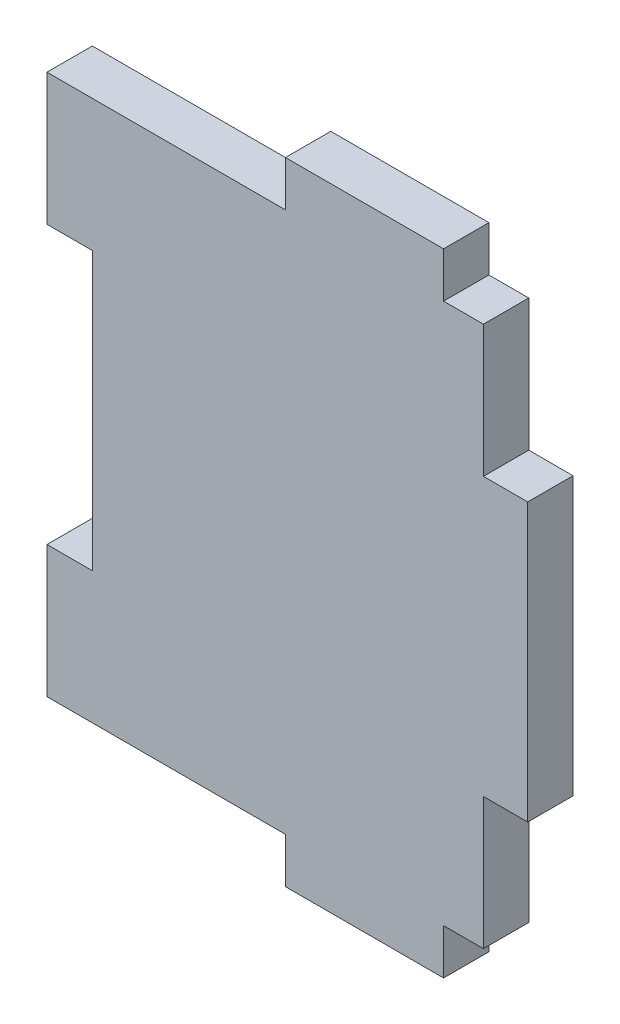
ISO-10303-21;
HEADER;
FILE_DESCRIPTION(('STEP AP214'),'2;1');
FILE_NAME('part.step','',(''),(''),'','','');
FILE_SCHEMA(('AUTOMOTIVE_DESIGN { 1 0 10303 214 1 1 1 1 }'));
ENDSEC;
DATA;
#1=APPLICATION_CONTEXT('core data for automotive mechanical design processes');
#2=APPLICATION_PROTOCOL_DEFINITION('international standard','automotive_design',2000,#1);
#3=PRODUCT_CONTEXT('',#1,'mechanical');
#4=PRODUCT('Part','Part','',(#3));
#5=PRODUCT_RELATED_PRODUCT_CATEGORY('part','',(#4));
#6=PRODUCT_DEFINITION_FORMATION('','',#4);
#7=PRODUCT_DEFINITION_CONTEXT('part definition',#1,'design');
#8=PRODUCT_DEFINITION('design','',#6,#7);
#9=PRODUCT_DEFINITION_SHAPE('','',#8);
#10=(LENGTH_UNIT() NAMED_UNIT(*) SI_UNIT(.MILLI.,.METRE.));
#11=(NAMED_UNIT(*) PLANE_ANGLE_UNIT() SI_UNIT($,.RADIAN.));
#12=(NAMED_UNIT(*) SI_UNIT($,.STERADIAN.) SOLID_ANGLE_UNIT());
#13=UNCERTAINTY_MEASURE_WITH_UNIT(LENGTH_MEASURE(1.E-05),#10,'distance_accuracy_value','');
#14=(GEOMETRIC_REPRESENTATION_CONTEXT(3) GLOBAL_UNCERTAINTY_ASSIGNED_CONTEXT((#13)) GLOBAL_UNIT_ASSIGNED_CONTEXT((#10,
#11,#12)) REPRESENTATION_CONTEXT('',''));
#15=CARTESIAN_POINT('',(0.,0.,0.));
#16=DIRECTION('',(0.,0.,1.));
#17=DIRECTION('',(1.,0.,0.));
#18=AXIS2_PLACEMENT_3D('',#15,#16,#17);
#19=CARTESIAN_POINT('',(0.,-32.5755,5.461));
#20=DIRECTION('',(0.,1.,0.));
#21=DIRECTION('',(0.,0.,1.));
#22=AXIS2_PLACEMENT_3D('',#19,#20,#21);
#23=PLANE('',#22);
#24=DIRECTION('',(0.,0.,1.));
#25=VECTOR('',#24,1.);
#26=CARTESIAN_POINT('',(21.4884,-32.5755,-19.8172909601691));
#27=LINE('',#26,#25);
#28=CARTESIAN_POINT('',(21.4884,-32.5755,0.));
#29=VERTEX_POINT('',#28);
#30=CARTESIAN_POINT('',(21.4884,-32.5755,5.461));
#31=VERTEX_POINT('',#30);
#32=EDGE_CURVE('E58',#29,#31,#27,.T.);
#33=ORIENTED_EDGE('',*,*,#32,.F.);
#34=DIRECTION('',(1.,0.,0.));
#35=VECTOR('',#34,1.);
#36=CARTESIAN_POINT('',(0.,-32.5755,0.));
#37=LINE('',#36,#35);
#38=CARTESIAN_POINT('',(26.289,-32.5755,0.));
#39=VERTEX_POINT('',#38);
#40=EDGE_CURVE('E266',#29,#39,#37,.T.);
#41=ORIENTED_EDGE('',*,*,#40,.T.);
#42=DIRECTION('',(0.,0.,-1.));
#43=VECTOR('',#42,1.);
#44=CARTESIAN_POINT('',(26.289,-32.5755,5.461));
#45=LINE('',#44,#43);
#46=CARTESIAN_POINT('',(26.289,-32.5755,5.461));
#47=VERTEX_POINT('',#46);
#48=EDGE_CURVE('E172',#47,#39,#45,.T.);
#49=ORIENTED_EDGE('',*,*,#48,.F.);
#50=DIRECTION('',(1.,0.,0.));
#51=VECTOR('',#50,1.);
#52=CARTESIAN_POINT('',(0.,-32.5755,5.461));
#53=LINE('',#52,#51);
#54=EDGE_CURVE('E170',#31,#47,#53,.T.);
#55=ORIENTED_EDGE('',*,*,#54,.F.);
#56=EDGE_LOOP('',(#33,#41,#49,#55));
#57=FACE_BOUND('',#56,.T.);
#58=ADVANCED_FACE('F35',(#57),#23,.F.);
#59=CARTESIAN_POINT('',(0.,32.5755,5.461));
#60=DIRECTION('',(0.,1.,0.));
#61=DIRECTION('',(0.,0.,1.));
#62=AXIS2_PLACEMENT_3D('',#59,#60,#61);
#63=PLANE('',#62);
#64=DIRECTION('',(1.,0.,0.));
#65=VECTOR('',#64,1.);
#66=CARTESIAN_POINT('',(0.,32.5755,0.));
#67=LINE('',#66,#65);
#68=CARTESIAN_POINT('',(21.4884,32.5755,0.));
#69=VERTEX_POINT('',#68);
#70=CARTESIAN_POINT('',(26.289,32.5755,0.));
#71=VERTEX_POINT('',#70);
#72=EDGE_CURVE('E284',#69,#71,#67,.T.);
#73=ORIENTED_EDGE('',*,*,#72,.F.);
#74=DIRECTION('',(0.,0.,1.));
#75=VECTOR('',#74,1.);
#76=CARTESIAN_POINT('',(21.4884,32.5755,-19.8172909601691));
#77=LINE('',#76,#75);
#78=CARTESIAN_POINT('',(21.4884,32.5755,5.461));
#79=VERTEX_POINT('',#78);
#80=EDGE_CURVE('E210',#69,#79,#77,.T.);
#81=ORIENTED_EDGE('',*,*,#80,.T.);
#82=DIRECTION('',(1.,0.,0.));
#83=VECTOR('',#82,1.);
#84=CARTESIAN_POINT('',(0.,32.5755,5.461));
#85=LINE('',#84,#83);
#86=CARTESIAN_POINT('',(26.289,32.5755,5.461));
#87=VERTEX_POINT('',#86);
#88=EDGE_CURVE('E256',#79,#87,#85,.T.);
#89=ORIENTED_EDGE('',*,*,#88,.T.);
#90=DIRECTION('',(0.,0.,-1.));
#91=VECTOR('',#90,1.);
#92=CARTESIAN_POINT('',(26.289,32.5755,5.461));
#93=LINE('',#92,#91);
#94=EDGE_CURVE('E289',#87,#71,#93,.T.);
#95=ORIENTED_EDGE('',*,*,#94,.T.);
#96=EDGE_LOOP('',(#73,#81,#89,#95));
#97=FACE_BOUND('',#96,.T.);
#98=ADVANCED_FACE('F348',(#97),#63,.T.);
#99=CARTESIAN_POINT('',(0.,16.7005,5.461));
#100=DIRECTION('',(0.,-1.,0.));
#101=DIRECTION('',(1.,0.,0.));
#102=AXIS2_PLACEMENT_3D('',#99,#100,#101);
#103=PLANE('',#102);
#104=DIRECTION('',(-1.,0.,0.));
#105=VECTOR('',#104,1.);
#106=CARTESIAN_POINT('',(0.,16.7005,0.));
#107=LINE('',#106,#105);
#108=CARTESIAN_POINT('',(-20.828,16.7005,0.));
#109=VERTEX_POINT('',#108);
#110=CARTESIAN_POINT('',(-26.289,16.7005,0.));
#111=VERTEX_POINT('',#110);
#112=EDGE_CURVE('E232',#109,#111,#107,.T.);
#113=ORIENTED_EDGE('',*,*,#112,.F.);
#114=DIRECTION('',(0.,0.,-1.));
#115=VECTOR('',#114,1.);
#116=CARTESIAN_POINT('',(-20.828,16.7005,5.461));
#117=LINE('',#116,#115);
#118=CARTESIAN_POINT('',(-20.828,16.7005,5.461));
#119=VERTEX_POINT('',#118);
#120=EDGE_CURVE('E11',#119,#109,#117,.T.);
#121=ORIENTED_EDGE('',*,*,#120,.F.);
#122=DIRECTION('',(-1.,0.,0.));
#123=VECTOR('',#122,1.);
#124=CARTESIAN_POINT('',(0.,16.7005,5.461));
#125=LINE('',#124,#123);
#126=CARTESIAN_POINT('',(-26.289,16.7005,5.461));
#127=VERTEX_POINT('',#126);
#128=EDGE_CURVE('E233',#119,#127,#125,.T.);
#129=ORIENTED_EDGE('',*,*,#128,.T.);
#130=DIRECTION('',(0.,0.,-1.));
#131=VECTOR('',#130,1.);
#132=CARTESIAN_POINT('',(-26.289,16.7005,5.461));
#133=LINE('',#132,#131);
#134=EDGE_CURVE('E285',#127,#111,#133,.T.);
#135=ORIENTED_EDGE('',*,*,#134,.T.);
#136=EDGE_LOOP('',(#113,#121,#129,#135));
#137=FACE_BOUND('',#136,.T.);
#138=ADVANCED_FACE('F37',(#137),#103,.T.);
#139=CARTESIAN_POINT('',(-20.828,0.,5.461));
#140=DIRECTION('',(-1.,0.,0.));
#141=DIRECTION('',(0.,0.,1.));
#142=AXIS2_PLACEMENT_3D('',#139,#140,#141);
#143=PLANE('',#142);
#144=DIRECTION('',(0.,1.,0.));
#145=VECTOR('',#144,1.);
#146=CARTESIAN_POINT('',(-20.828,0.,0.));
#147=LINE('',#146,#145);
#148=CARTESIAN_POINT('',(-20.828,-16.7005,0.));
#149=VERTEX_POINT('',#148);
#150=EDGE_CURVE('E259',#149,#109,#147,.T.);
#151=ORIENTED_EDGE('',*,*,#150,.F.);
#152=DIRECTION('',(0.,0.,-1.));
#153=VECTOR('',#152,1.);
#154=CARTESIAN_POINT('',(-20.828,-16.7005,5.461));
#155=LINE('',#154,#153);
#156=CARTESIAN_POINT('',(-20.828,-16.7005,5.461));
#157=VERTEX_POINT('',#156);
#158=EDGE_CURVE('E43',#157,#149,#155,.T.);
#159=ORIENTED_EDGE('',*,*,#158,.F.);
#160=DIRECTION('',(0.,1.,0.));
#161=VECTOR('',#160,1.);
#162=CARTESIAN_POINT('',(-20.828,0.,5.461));
#163=LINE('',#162,#161);
#164=EDGE_CURVE('E236',#157,#119,#163,.T.);
#165=ORIENTED_EDGE('',*,*,#164,.T.);
#166=ORIENTED_EDGE('',*,*,#120,.T.);
#167=EDGE_LOOP('',(#151,#159,#165,#166));
#168=FACE_BOUND('',#167,.T.);
#169=ADVANCED_FACE('F319',(#168),#143,.T.);
#170=CARTESIAN_POINT('',(0.,-16.7005,5.461));
#171=DIRECTION('',(0.,-1.,0.));
#172=DIRECTION('',(0.,0.,-1.));
#173=AXIS2_PLACEMENT_3D('',#170,#171,#172);
#174=PLANE('',#173);
#175=DIRECTION('',(-1.,0.,0.));
#176=VECTOR('',#175,1.);
#177=CARTESIAN_POINT('',(0.,-16.7005,0.));
#178=LINE('',#177,#176);
#179=CARTESIAN_POINT('',(-26.289,-16.7005,0.));
#180=VERTEX_POINT('',#179);
#181=EDGE_CURVE('E262',#149,#180,#178,.T.);
#182=ORIENTED_EDGE('',*,*,#181,.T.);
#183=DIRECTION('',(0.,0.,-1.));
#184=VECTOR('',#183,1.);
#185=CARTESIAN_POINT('',(-26.289,-16.7005,5.461));
#186=LINE('',#185,#184);
#187=CARTESIAN_POINT('',(-26.289,-16.7005,5.461));
#188=VERTEX_POINT('',#187);
#189=EDGE_CURVE('E305',#188,#180,#186,.T.);
#190=ORIENTED_EDGE('',*,*,#189,.F.);
#191=DIRECTION('',(-1.,0.,0.));
#192=VECTOR('',#191,1.);
#193=CARTESIAN_POINT('',(0.,-16.7005,5.461));
#194=LINE('',#193,#192);
#195=EDGE_CURVE('E240',#157,#188,#194,.T.);
#196=ORIENTED_EDGE('',*,*,#195,.F.);
#197=ORIENTED_EDGE('',*,*,#158,.T.);
#198=EDGE_LOOP('',(#182,#190,#196,#197));
#199=FACE_BOUND('',#198,.T.);
#200=ADVANCED_FACE('F310',(#199),#174,.F.);
#201=CARTESIAN_POINT('',(-26.289,0.,5.461));
#202=DIRECTION('',(1.,0.,0.));
#203=DIRECTION('',(0.,0.,-1.));
#204=AXIS2_PLACEMENT_3D('',#201,#202,#203);
#205=PLANE('',#204);
#206=DIRECTION('',(0.,-1.,0.));
#207=VECTOR('',#206,1.);
#208=CARTESIAN_POINT('',(-26.289,0.,0.));
#209=LINE('',#208,#207);
#210=CARTESIAN_POINT('',(-26.289,-32.5755,0.));
#211=VERTEX_POINT('',#210);
#212=EDGE_CURVE('E264',#180,#211,#209,.T.);
#213=ORIENTED_EDGE('',*,*,#212,.T.);
#214=DIRECTION('',(0.,0.,-1.));
#215=VECTOR('',#214,1.);
#216=CARTESIAN_POINT('',(-26.289,-32.5755,5.461));
#217=LINE('',#216,#215);
#218=CARTESIAN_POINT('',(-26.289,-32.5755,5.461));
#219=VERTEX_POINT('',#218);
#220=EDGE_CURVE('E302',#219,#211,#217,.T.);
#221=ORIENTED_EDGE('',*,*,#220,.F.);
#222=DIRECTION('',(0.,-1.,0.));
#223=VECTOR('',#222,1.);
#224=CARTESIAN_POINT('',(-26.289,0.,5.461));
#225=LINE('',#224,#223);
#226=EDGE_CURVE('E178',#188,#219,#225,.T.);
#227=ORIENTED_EDGE('',*,*,#226,.F.);
#228=ORIENTED_EDGE('',*,*,#189,.T.);
#229=EDGE_LOOP('',(#213,#221,#227,#228));
#230=FACE_BOUND('',#229,.T.);
#231=ADVANCED_FACE('F382',(#230),#205,.F.);
#232=CARTESIAN_POINT('',(2.4384,-32.5755,0.));
#233=VERTEX_POINT('',#232);
#234=EDGE_CURVE('E267',#211,#233,#37,.T.);
#235=ORIENTED_EDGE('',*,*,#234,.T.);
#236=DIRECTION('',(0.,0.,1.));
#237=VECTOR('',#236,1.);
#238=CARTESIAN_POINT('',(2.4384,-32.5755,-19.8172909601691));
#239=LINE('',#238,#237);
#240=CARTESIAN_POINT('',(2.4384,-32.5755,5.461));
#241=VERTEX_POINT('',#240);
#242=EDGE_CURVE('E50',#233,#241,#239,.T.);
#243=ORIENTED_EDGE('',*,*,#242,.T.);
#244=EDGE_CURVE('E177',#219,#241,#53,.T.);
#245=ORIENTED_EDGE('',*,*,#244,.F.);
#246=ORIENTED_EDGE('',*,*,#220,.T.);
#247=EDGE_LOOP('',(#235,#243,#245,#246));
#248=FACE_BOUND('',#247,.T.);
#249=ADVANCED_FACE('F374',(#248),#23,.F.);
#250=CARTESIAN_POINT('',(26.289,0.,5.461));
#251=DIRECTION('',(1.,0.,0.));
#252=DIRECTION('',(0.,0.,-1.));
#253=AXIS2_PLACEMENT_3D('',#250,#251,#252);
#254=PLANE('',#253);
#255=DIRECTION('',(0.,-1.,0.));
#256=VECTOR('',#255,1.);
#257=CARTESIAN_POINT('',(26.289,0.,0.));
#258=LINE('',#257,#256);
#259=CARTESIAN_POINT('',(26.289,-16.7005,0.));
#260=VERTEX_POINT('',#259);
#261=EDGE_CURVE('E269',#260,#39,#258,.T.);
#262=ORIENTED_EDGE('',*,*,#261,.F.);
#263=DIRECTION('',(0.,0.,-1.));
#264=VECTOR('',#263,1.);
#265=CARTESIAN_POINT('',(26.289,-16.7005,5.461));
#266=LINE('',#265,#264);
#267=CARTESIAN_POINT('',(26.289,-16.7005,5.461));
#268=VERTEX_POINT('',#267);
#269=EDGE_CURVE('E299',#268,#260,#266,.T.);
#270=ORIENTED_EDGE('',*,*,#269,.F.);
#271=DIRECTION('',(0.,-1.,0.));
#272=VECTOR('',#271,1.);
#273=CARTESIAN_POINT('',(26.289,0.,5.461));
#274=LINE('',#273,#272);
#275=EDGE_CURVE('E244',#268,#47,#274,.T.);
#276=ORIENTED_EDGE('',*,*,#275,.T.);
#277=ORIENTED_EDGE('',*,*,#48,.T.);
#278=EDGE_LOOP('',(#262,#270,#276,#277));
#279=FACE_BOUND('',#278,.T.);
#280=ADVANCED_FACE('F372',(#279),#254,.T.);
#281=CARTESIAN_POINT('',(0.,-16.7005,5.461));
#282=DIRECTION('',(0.,-1.,0.));
#283=DIRECTION('',(1.,0.,0.));
#284=AXIS2_PLACEMENT_3D('',#281,#282,#283);
#285=PLANE('',#284);
#286=DIRECTION('',(-1.,0.,0.));
#287=VECTOR('',#286,1.);
#288=CARTESIAN_POINT('',(0.,-16.7005,0.));
#289=LINE('',#288,#287);
#290=CARTESIAN_POINT('',(31.623,-16.7005,0.));
#291=VERTEX_POINT('',#290);
#292=EDGE_CURVE('E272',#291,#260,#289,.T.);
#293=ORIENTED_EDGE('',*,*,#292,.F.);
#294=DIRECTION('',(0.,0.,-1.));
#295=VECTOR('',#294,1.);
#296=CARTESIAN_POINT('',(31.623,-16.7005,5.461));
#297=LINE('',#296,#295);
#298=CARTESIAN_POINT('',(31.623,-16.7005,5.461));
#299=VERTEX_POINT('',#298);
#300=EDGE_CURVE('E297',#299,#291,#297,.T.);
#301=ORIENTED_EDGE('',*,*,#300,.F.);
#302=DIRECTION('',(-1.,0.,0.));
#303=VECTOR('',#302,1.);
#304=CARTESIAN_POINT('',(0.,-16.7005,5.461));
#305=LINE('',#304,#303);
#306=EDGE_CURVE('E246',#299,#268,#305,.T.);
#307=ORIENTED_EDGE('',*,*,#306,.T.);
#308=ORIENTED_EDGE('',*,*,#269,.T.);
#309=EDGE_LOOP('',(#293,#301,#307,#308));
#310=FACE_BOUND('',#309,.T.);
#311=ADVANCED_FACE('F369',(#310),#285,.T.);
#312=CARTESIAN_POINT('',(31.623,0.,5.461));
#313=DIRECTION('',(-1.,0.,0.));
#314=DIRECTION('',(0.,0.,1.));
#315=AXIS2_PLACEMENT_3D('',#312,#313,#314);
#316=PLANE('',#315);
#317=DIRECTION('',(0.,1.,0.));
#318=VECTOR('',#317,1.);
#319=CARTESIAN_POINT('',(31.623,0.,0.));
#320=LINE('',#319,#318);
#321=CARTESIAN_POINT('',(31.623,16.7005,0.));
#322=VERTEX_POINT('',#321);
#323=EDGE_CURVE('E276',#291,#322,#320,.T.);
#324=ORIENTED_EDGE('',*,*,#323,.T.);
#325=DIRECTION('',(0.,0.,-1.));
#326=VECTOR('',#325,1.);
#327=CARTESIAN_POINT('',(31.623,16.7005,5.461));
#328=LINE('',#327,#326);
#329=CARTESIAN_POINT('',(31.623,16.7005,5.461));
#330=VERTEX_POINT('',#329);
#331=EDGE_CURVE('E294',#330,#322,#328,.T.);
#332=ORIENTED_EDGE('',*,*,#331,.F.);
#333=DIRECTION('',(0.,1.,0.));
#334=VECTOR('',#333,1.);
#335=CARTESIAN_POINT('',(31.623,0.,5.461));
#336=LINE('',#335,#334);
#337=EDGE_CURVE('E250',#299,#330,#336,.T.);
#338=ORIENTED_EDGE('',*,*,#337,.F.);
#339=ORIENTED_EDGE('',*,*,#300,.T.);
#340=EDGE_LOOP('',(#324,#332,#338,#339));
#341=FACE_BOUND('',#340,.T.);
#342=ADVANCED_FACE('F366',(#341),#316,.F.);
#343=CARTESIAN_POINT('',(0.,16.7005000000001,5.461));
#344=DIRECTION('',(0.,-1.,0.));
#345=DIRECTION('',(1.,0.,0.));
#346=AXIS2_PLACEMENT_3D('',#343,#344,#345);
#347=PLANE('',#346);
#348=DIRECTION('',(-1.,0.,0.));
#349=VECTOR('',#348,1.);
#350=CARTESIAN_POINT('',(0.,16.7005000000001,0.));
#351=LINE('',#350,#349);
#352=CARTESIAN_POINT('',(26.289,16.7005,0.));
#353=VERTEX_POINT('',#352);
#354=EDGE_CURVE('E278',#322,#353,#351,.T.);
#355=ORIENTED_EDGE('',*,*,#354,.T.);
#356=DIRECTION('',(0.,0.,-1.));
#357=VECTOR('',#356,1.);
#358=CARTESIAN_POINT('',(26.289,16.7005,5.461));
#359=LINE('',#358,#357);
#360=CARTESIAN_POINT('',(26.289,16.7005,5.461));
#361=VERTEX_POINT('',#360);
#362=EDGE_CURVE('E292',#361,#353,#359,.T.);
#363=ORIENTED_EDGE('',*,*,#362,.F.);
#364=DIRECTION('',(-1.,0.,0.));
#365=VECTOR('',#364,1.);
#366=CARTESIAN_POINT('',(0.,16.7005000000001,5.461));
#367=LINE('',#366,#365);
#368=EDGE_CURVE('E252',#330,#361,#367,.T.);
#369=ORIENTED_EDGE('',*,*,#368,.F.);
#370=ORIENTED_EDGE('',*,*,#331,.T.);
#371=EDGE_LOOP('',(#355,#363,#369,#370));
#372=FACE_BOUND('',#371,.T.);
#373=ADVANCED_FACE('F361',(#372),#347,.F.);
#374=EDGE_CURVE('E273',#71,#353,#258,.T.);
#375=ORIENTED_EDGE('',*,*,#374,.F.);
#376=ORIENTED_EDGE('',*,*,#94,.F.);
#377=EDGE_CURVE('E247',#87,#361,#274,.T.);
#378=ORIENTED_EDGE('',*,*,#377,.T.);
#379=ORIENTED_EDGE('',*,*,#362,.T.);
#380=EDGE_LOOP('',(#375,#376,#378,#379));
#381=FACE_BOUND('',#380,.T.);
#382=ADVANCED_FACE('F354',(#381),#254,.T.);
#383=DIRECTION('',(0.,0.,1.));
#384=VECTOR('',#383,1.);
#385=CARTESIAN_POINT('',(2.4384,32.5755,-19.8172909601691));
#386=LINE('',#385,#384);
#387=CARTESIAN_POINT('',(2.4384,32.5755,0.));
#388=VERTEX_POINT('',#387);
#389=CARTESIAN_POINT('',(2.4384,32.5755,5.461));
#390=VERTEX_POINT('',#389);
#391=EDGE_CURVE('E225',#388,#390,#386,.T.);
#392=ORIENTED_EDGE('',*,*,#391,.F.);
#393=CARTESIAN_POINT('',(-26.289,32.5755,0.));
#394=VERTEX_POINT('',#393);
#395=EDGE_CURVE('E281',#394,#388,#67,.T.);
#396=ORIENTED_EDGE('',*,*,#395,.F.);
#397=DIRECTION('',(0.,0.,-1.));
#398=VECTOR('',#397,1.);
#399=CARTESIAN_POINT('',(-26.289,32.5755,5.461));
#400=LINE('',#399,#398);
#401=CARTESIAN_POINT('',(-26.289,32.5755,5.461));
#402=VERTEX_POINT('',#401);
#403=EDGE_CURVE('E287',#402,#394,#400,.T.);
#404=ORIENTED_EDGE('',*,*,#403,.F.);
#405=EDGE_CURVE('E254',#402,#390,#85,.T.);
#406=ORIENTED_EDGE('',*,*,#405,.T.);
#407=EDGE_LOOP('',(#392,#396,#404,#406));
#408=FACE_BOUND('',#407,.T.);
#409=ADVANCED_FACE('F329',(#408),#63,.T.);
#410=EDGE_CURVE('E237',#394,#111,#209,.T.);
#411=ORIENTED_EDGE('',*,*,#410,.T.);
#412=ORIENTED_EDGE('',*,*,#134,.F.);
#413=EDGE_CURVE('E242',#402,#127,#225,.T.);
#414=ORIENTED_EDGE('',*,*,#413,.F.);
#415=ORIENTED_EDGE('',*,*,#403,.T.);
#416=EDGE_LOOP('',(#411,#412,#414,#415));
#417=FACE_BOUND('',#416,.T.);
#418=ADVANCED_FACE('F421',(#417),#205,.F.);
#419=CARTESIAN_POINT('',(0.,0.,5.461));
#420=DIRECTION('',(0.,0.,1.));
#421=DIRECTION('',(1.,0.,0.));
#422=AXIS2_PLACEMENT_3D('',#419,#420,#421);
#423=PLANE('',#422);
#424=ORIENTED_EDGE('',*,*,#128,.F.);
#425=ORIENTED_EDGE('',*,*,#164,.F.);
#426=ORIENTED_EDGE('',*,*,#195,.T.);
#427=ORIENTED_EDGE('',*,*,#226,.T.);
#428=ORIENTED_EDGE('',*,*,#244,.T.);
#429=DIRECTION('',(0.,-1.,0.));
#430=VECTOR('',#429,1.);
#431=CARTESIAN_POINT('',(2.4384,-32.5755,5.461));
#432=LINE('',#431,#430);
#433=CARTESIAN_POINT('',(2.4384,-38.0365,5.461));
#434=VERTEX_POINT('',#433);
#435=EDGE_CURVE('E194',#241,#434,#432,.T.);
#436=ORIENTED_EDGE('',*,*,#435,.T.);
#437=DIRECTION('',(1.,0.,0.));
#438=VECTOR('',#437,1.);
#439=CARTESIAN_POINT('',(21.4884,-38.0365,5.461));
#440=LINE('',#439,#438);
#441=CARTESIAN_POINT('',(21.4884,-38.0365,5.461));
#442=VERTEX_POINT('',#441);
#443=EDGE_CURVE('E188',#434,#442,#440,.T.);
#444=ORIENTED_EDGE('',*,*,#443,.T.);
#445=DIRECTION('',(0.,1.,0.));
#446=VECTOR('',#445,1.);
#447=CARTESIAN_POINT('',(21.4884,-32.5755,5.461));
#448=LINE('',#447,#446);
#449=EDGE_CURVE('E185',#442,#31,#448,.T.);
#450=ORIENTED_EDGE('',*,*,#449,.T.);
#451=ORIENTED_EDGE('',*,*,#54,.T.);
#452=ORIENTED_EDGE('',*,*,#275,.F.);
#453=ORIENTED_EDGE('',*,*,#306,.F.);
#454=ORIENTED_EDGE('',*,*,#337,.T.);
#455=ORIENTED_EDGE('',*,*,#368,.T.);
#456=ORIENTED_EDGE('',*,*,#377,.F.);
#457=ORIENTED_EDGE('',*,*,#88,.F.);
#458=DIRECTION('',(0.,1.,0.));
#459=VECTOR('',#458,1.);
#460=CARTESIAN_POINT('',(21.4884,32.5755,5.461));
#461=LINE('',#460,#459);
#462=CARTESIAN_POINT('',(21.4884,38.0365,5.461));
#463=VERTEX_POINT('',#462);
#464=EDGE_CURVE('E214',#79,#463,#461,.T.);
#465=ORIENTED_EDGE('',*,*,#464,.T.);
#466=DIRECTION('',(-1.,0.,0.));
#467=VECTOR('',#466,1.);
#468=CARTESIAN_POINT('',(21.4884,38.0365,5.461));
#469=LINE('',#468,#467);
#470=CARTESIAN_POINT('',(2.4384,38.0365,5.461));
#471=VERTEX_POINT('',#470);
#472=EDGE_CURVE('E217',#463,#471,#469,.T.);
#473=ORIENTED_EDGE('',*,*,#472,.T.);
#474=DIRECTION('',(0.,-1.,0.));
#475=VECTOR('',#474,1.);
#476=CARTESIAN_POINT('',(2.4384,32.5755,5.461));
#477=LINE('',#476,#475);
#478=EDGE_CURVE('E220',#471,#390,#477,.T.);
#479=ORIENTED_EDGE('',*,*,#478,.T.);
#480=ORIENTED_EDGE('',*,*,#405,.F.);
#481=ORIENTED_EDGE('',*,*,#413,.T.);
#482=EDGE_LOOP('',(#424,#425,#426,#427,#428,#436,#444,#450,#451,#452,#453,#454,#455,#456,#457,
#465,#473,#479,#480,#481));
#483=FACE_BOUND('',#482,.T.);
#484=ADVANCED_FACE('F191',(#483),#423,.T.);
#485=CARTESIAN_POINT('',(0.,0.,0.));
#486=DIRECTION('',(0.,0.,1.));
#487=DIRECTION('',(1.,0.,0.));
#488=AXIS2_PLACEMENT_3D('',#485,#486,#487);
#489=PLANE('',#488);
#490=ORIENTED_EDGE('',*,*,#112,.T.);
#491=ORIENTED_EDGE('',*,*,#410,.F.);
#492=ORIENTED_EDGE('',*,*,#395,.T.);
#493=DIRECTION('',(0.,1.,0.));
#494=VECTOR('',#493,1.);
#495=CARTESIAN_POINT('',(2.4384,32.5755,0.));
#496=LINE('',#495,#494);
#497=CARTESIAN_POINT('',(2.4384,38.0365,0.));
#498=VERTEX_POINT('',#497);
#499=EDGE_CURVE('E207',#388,#498,#496,.T.);
#500=ORIENTED_EDGE('',*,*,#499,.T.);
#501=DIRECTION('',(1.,0.,0.));
#502=VECTOR('',#501,1.);
#503=CARTESIAN_POINT('',(21.4884,38.0365,0.));
#504=LINE('',#503,#502);
#505=CARTESIAN_POINT('',(21.4884,38.0365,0.));
#506=VERTEX_POINT('',#505);
#507=EDGE_CURVE('E213',#498,#506,#504,.T.);
#508=ORIENTED_EDGE('',*,*,#507,.T.);
#509=DIRECTION('',(0.,-1.,0.));
#510=VECTOR('',#509,1.);
#511=CARTESIAN_POINT('',(21.4884,32.5755,0.));
#512=LINE('',#511,#510);
#513=EDGE_CURVE('E209',#506,#69,#512,.T.);
#514=ORIENTED_EDGE('',*,*,#513,.T.);
#515=ORIENTED_EDGE('',*,*,#72,.T.);
#516=ORIENTED_EDGE('',*,*,#374,.T.);
#517=ORIENTED_EDGE('',*,*,#354,.F.);
#518=ORIENTED_EDGE('',*,*,#323,.F.);
#519=ORIENTED_EDGE('',*,*,#292,.T.);
#520=ORIENTED_EDGE('',*,*,#261,.T.);
#521=ORIENTED_EDGE('',*,*,#40,.F.);
#522=DIRECTION('',(0.,-1.,0.));
#523=VECTOR('',#522,1.);
#524=CARTESIAN_POINT('',(21.4884,-32.5755,0.));
#525=LINE('',#524,#523);
#526=CARTESIAN_POINT('',(21.4884,-38.0365,0.));
#527=VERTEX_POINT('',#526);
#528=EDGE_CURVE('E187',#29,#527,#525,.T.);
#529=ORIENTED_EDGE('',*,*,#528,.T.);
#530=DIRECTION('',(-1.,0.,0.));
#531=VECTOR('',#530,1.);
#532=CARTESIAN_POINT('',(21.4884,-38.0365,0.));
#533=LINE('',#532,#531);
#534=CARTESIAN_POINT('',(2.4384,-38.0365,0.));
#535=VERTEX_POINT('',#534);
#536=EDGE_CURVE('E575',#527,#535,#533,.T.);
#537=ORIENTED_EDGE('',*,*,#536,.T.);
#538=DIRECTION('',(0.,1.,0.));
#539=VECTOR('',#538,1.);
#540=CARTESIAN_POINT('',(2.4384,-32.5755,0.));
#541=LINE('',#540,#539);
#542=EDGE_CURVE('E203',#535,#233,#541,.T.);
#543=ORIENTED_EDGE('',*,*,#542,.T.);
#544=ORIENTED_EDGE('',*,*,#234,.F.);
#545=ORIENTED_EDGE('',*,*,#212,.F.);
#546=ORIENTED_EDGE('',*,*,#181,.F.);
#547=ORIENTED_EDGE('',*,*,#150,.T.);
#548=EDGE_LOOP('',(#490,#491,#492,#500,#508,#514,#515,#516,#517,#518,#519,#520,#521,#529,#537,
#543,#544,#545,#546,#547));
#549=FACE_BOUND('',#548,.T.);
#550=ADVANCED_FACE('F317',(#549),#489,.F.);
#551=CARTESIAN_POINT('',(21.4884,32.5755,-19.8172909601691));
#552=DIRECTION('',(1.,0.,0.));
#553=DIRECTION('',(0.,0.,-1.));
#554=AXIS2_PLACEMENT_3D('',#551,#552,#553);
#555=PLANE('',#554);
#556=ORIENTED_EDGE('',*,*,#513,.F.);
#557=DIRECTION('',(0.,0.,1.));
#558=VECTOR('',#557,1.);
#559=CARTESIAN_POINT('',(21.4884,38.0365,-19.8172909601691));
#560=LINE('',#559,#558);
#561=EDGE_CURVE('E223',#506,#463,#560,.T.);
#562=ORIENTED_EDGE('',*,*,#561,.T.);
#563=ORIENTED_EDGE('',*,*,#464,.F.);
#564=ORIENTED_EDGE('',*,*,#80,.F.);
#565=EDGE_LOOP('',(#556,#562,#563,#564));
#566=FACE_BOUND('',#565,.T.);
#567=ADVANCED_FACE('F346',(#566),#555,.T.);
#568=CARTESIAN_POINT('',(2.4384,32.5755,-19.8172909601691));
#569=DIRECTION('',(-1.,0.,0.));
#570=DIRECTION('',(0.,-1.,0.));
#571=AXIS2_PLACEMENT_3D('',#568,#569,#570);
#572=PLANE('',#571);
#573=ORIENTED_EDGE('',*,*,#499,.F.);
#574=ORIENTED_EDGE('',*,*,#391,.T.);
#575=ORIENTED_EDGE('',*,*,#478,.F.);
#576=DIRECTION('',(0.,0.,1.));
#577=VECTOR('',#576,1.);
#578=CARTESIAN_POINT('',(2.4384,38.0365,-19.8172909601691));
#579=LINE('',#578,#577);
#580=EDGE_CURVE('E228',#498,#471,#579,.T.);
#581=ORIENTED_EDGE('',*,*,#580,.F.);
#582=EDGE_LOOP('',(#573,#574,#575,#581));
#583=FACE_BOUND('',#582,.T.);
#584=ADVANCED_FACE('F334',(#583),#572,.T.);
#585=CARTESIAN_POINT('',(21.4884,38.0365,-19.8172909601691));
#586=DIRECTION('',(0.,1.,0.));
#587=DIRECTION('',(0.,0.,1.));
#588=AXIS2_PLACEMENT_3D('',#585,#586,#587);
#589=PLANE('',#588);
#590=ORIENTED_EDGE('',*,*,#507,.F.);
#591=ORIENTED_EDGE('',*,*,#580,.T.);
#592=ORIENTED_EDGE('',*,*,#472,.F.);
#593=ORIENTED_EDGE('',*,*,#561,.F.);
#594=EDGE_LOOP('',(#590,#591,#592,#593));
#595=FACE_BOUND('',#594,.T.);
#596=ADVANCED_FACE('F342',(#595),#589,.T.);
#597=CARTESIAN_POINT('',(21.4884,-32.5755,-19.8172909601691));
#598=DIRECTION('',(1.,0.,0.));
#599=DIRECTION('',(0.,1.,0.));
#600=AXIS2_PLACEMENT_3D('',#597,#598,#599);
#601=PLANE('',#600);
#602=ORIENTED_EDGE('',*,*,#528,.F.);
#603=ORIENTED_EDGE('',*,*,#32,.T.);
#604=ORIENTED_EDGE('',*,*,#449,.F.);
#605=DIRECTION('',(0.,0.,1.));
#606=VECTOR('',#605,1.);
#607=CARTESIAN_POINT('',(21.4884,-38.0365,-19.8172909601691));
#608=LINE('',#607,#606);
#609=EDGE_CURVE('E201',#527,#442,#608,.T.);
#610=ORIENTED_EDGE('',*,*,#609,.F.);
#611=EDGE_LOOP('',(#602,#603,#604,#610));
#612=FACE_BOUND('',#611,.T.);
#613=ADVANCED_FACE('F183',(#612),#601,.T.);
#614=CARTESIAN_POINT('',(21.4884,-38.0365,-19.8172909601691));
#615=DIRECTION('',(0.,-1.,0.));
#616=DIRECTION('',(0.,0.,-1.));
#617=AXIS2_PLACEMENT_3D('',#614,#615,#616);
#618=PLANE('',#617);
#619=ORIENTED_EDGE('',*,*,#536,.F.);
#620=ORIENTED_EDGE('',*,*,#609,.T.);
#621=ORIENTED_EDGE('',*,*,#443,.F.);
#622=DIRECTION('',(0.,0.,1.));
#623=VECTOR('',#622,1.);
#624=CARTESIAN_POINT('',(2.4384,-38.0365,-19.8172909601691));
#625=LINE('',#624,#623);
#626=EDGE_CURVE('E204',#535,#434,#625,.T.);
#627=ORIENTED_EDGE('',*,*,#626,.F.);
#628=EDGE_LOOP('',(#619,#620,#621,#627));
#629=FACE_BOUND('',#628,.T.);
#630=ADVANCED_FACE('F515',(#629),#618,.T.);
#631=CARTESIAN_POINT('',(2.4384,-32.5755,-19.8172909601691));
#632=DIRECTION('',(-1.,0.,0.));
#633=DIRECTION('',(0.,-1.,0.));
#634=AXIS2_PLACEMENT_3D('',#631,#632,#633);
#635=PLANE('',#634);
#636=ORIENTED_EDGE('',*,*,#542,.F.);
#637=ORIENTED_EDGE('',*,*,#626,.T.);
#638=ORIENTED_EDGE('',*,*,#435,.F.);
#639=ORIENTED_EDGE('',*,*,#242,.F.);
#640=EDGE_LOOP('',(#636,#637,#638,#639));
#641=FACE_BOUND('',#640,.T.);
#642=ADVANCED_FACE('F522',(#641),#635,.T.);
#643=CLOSED_SHELL('',(#58,#98,#138,#169,#200,#231,#249,#280,#311,#342,#373,#382,#409,#418,#484,
#550,#567,#584,#596,#613,#630,#642));
#644=MANIFOLD_SOLID_BREP('B2',#643);
#645=ADVANCED_BREP_SHAPE_REPRESENTATION('',(#18,#644),#14);
#646=SHAPE_DEFINITION_REPRESENTATION(#9,#645);
ENDSEC;
END-ISO-10303-21;
